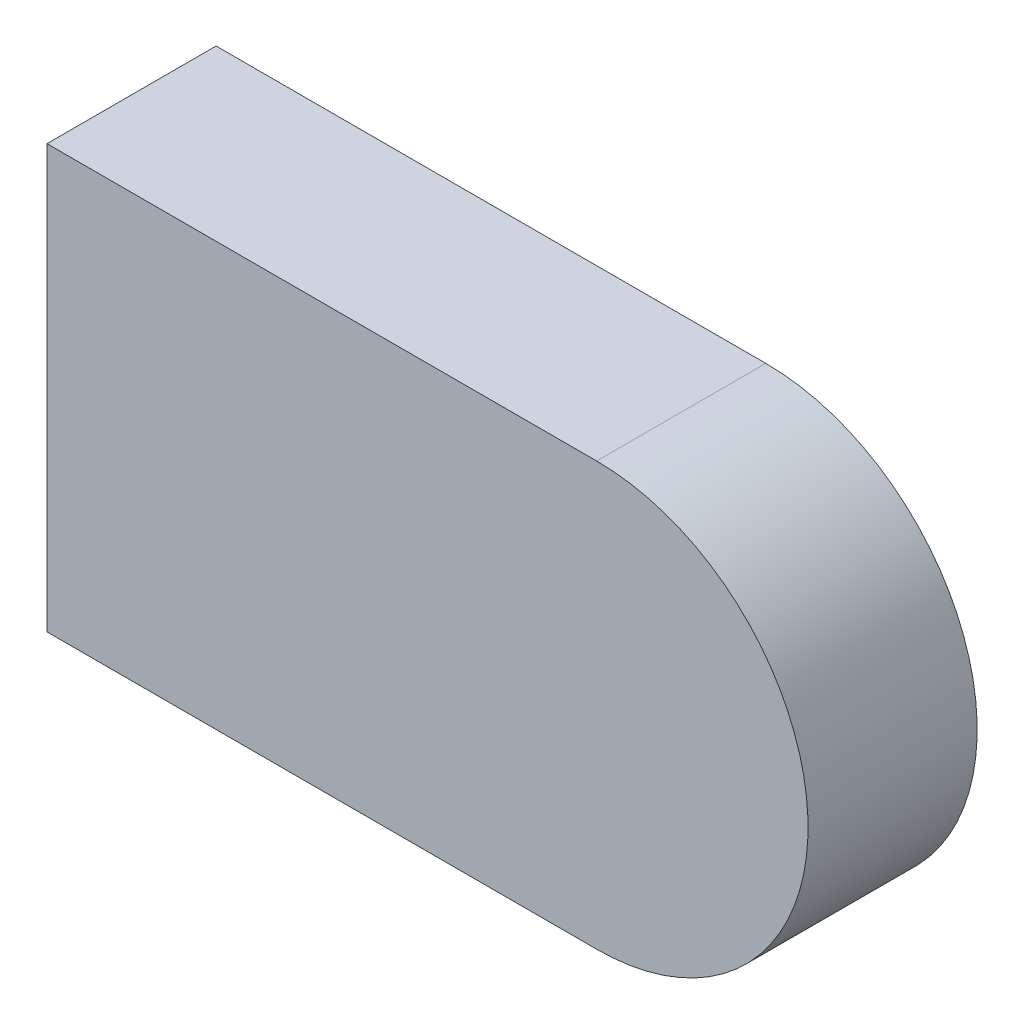
ISO-10303-21;
HEADER;
FILE_DESCRIPTION(('STEP AP214'),'2;1');
FILE_NAME('part.step','',(''),(''),'','','');
FILE_SCHEMA(('AUTOMOTIVE_DESIGN { 1 0 10303 214 1 1 1 1 }'));
ENDSEC;
DATA;
#1=APPLICATION_CONTEXT('core data for automotive mechanical design processes');
#2=APPLICATION_PROTOCOL_DEFINITION('international standard','automotive_design',2000,#1);
#3=PRODUCT_CONTEXT('',#1,'mechanical');
#4=PRODUCT('Part','Part','',(#3));
#5=PRODUCT_RELATED_PRODUCT_CATEGORY('part','',(#4));
#6=PRODUCT_DEFINITION_FORMATION('','',#4);
#7=PRODUCT_DEFINITION_CONTEXT('part definition',#1,'design');
#8=PRODUCT_DEFINITION('design','',#6,#7);
#9=PRODUCT_DEFINITION_SHAPE('','',#8);
#10=(LENGTH_UNIT() NAMED_UNIT(*) SI_UNIT(.MILLI.,.METRE.));
#11=(NAMED_UNIT(*) PLANE_ANGLE_UNIT() SI_UNIT($,.RADIAN.));
#12=(NAMED_UNIT(*) SI_UNIT($,.STERADIAN.) SOLID_ANGLE_UNIT());
#13=UNCERTAINTY_MEASURE_WITH_UNIT(LENGTH_MEASURE(1.E-05),#10,'distance_accuracy_value','');
#14=(GEOMETRIC_REPRESENTATION_CONTEXT(3) GLOBAL_UNCERTAINTY_ASSIGNED_CONTEXT((#13)) GLOBAL_UNIT_ASSIGNED_CONTEXT((#10,
#11,#12)) REPRESENTATION_CONTEXT('',''));
#15=CARTESIAN_POINT('',(0.,0.,0.));
#16=DIRECTION('',(0.,0.,1.));
#17=DIRECTION('',(1.,0.,0.));
#18=AXIS2_PLACEMENT_3D('',#15,#16,#17);
#19=CARTESIAN_POINT('',(-2.05,0.625,0.));
#20=DIRECTION('',(0.,1.,0.));
#21=DIRECTION('',(1.,0.,0.));
#22=AXIS2_PLACEMENT_3D('',#19,#20,#21);
#23=PLANE('',#22);
#24=DIRECTION('',(1.,0.,0.));
#25=VECTOR('',#24,1.);
#26=CARTESIAN_POINT('',(-2.05,0.625,0.));
#27=LINE('',#26,#25);
#28=CARTESIAN_POINT('',(-2.05,0.625,0.));
#29=VERTEX_POINT('',#28);
#30=CARTESIAN_POINT('',(-1.725,0.625,0.));
#31=VERTEX_POINT('',#30);
#32=EDGE_CURVE('E11',#29,#31,#27,.T.);
#33=ORIENTED_EDGE('',*,*,#32,.T.);
#34=DIRECTION('',(0.,0.,1.));
#35=VECTOR('',#34,1.);
#36=CARTESIAN_POINT('',(-1.725,0.625,0.));
#37=LINE('',#36,#35);
#38=CARTESIAN_POINT('',(-1.725,0.625,0.1));
#39=VERTEX_POINT('',#38);
#40=EDGE_CURVE('E24',#31,#39,#37,.T.);
#41=ORIENTED_EDGE('',*,*,#40,.T.);
#42=DIRECTION('',(1.,0.,0.));
#43=VECTOR('',#42,1.);
#44=CARTESIAN_POINT('',(-2.05,0.625,0.1));
#45=LINE('',#44,#43);
#46=CARTESIAN_POINT('',(-2.05,0.625,0.1));
#47=VERTEX_POINT('',#46);
#48=EDGE_CURVE('E88',#47,#39,#45,.T.);
#49=ORIENTED_EDGE('',*,*,#48,.F.);
#50=DIRECTION('',(0.,0.,1.));
#51=VECTOR('',#50,1.);
#52=CARTESIAN_POINT('',(-2.05,0.625,0.));
#53=LINE('',#52,#51);
#54=EDGE_CURVE('E36',#29,#47,#53,.T.);
#55=ORIENTED_EDGE('',*,*,#54,.F.);
#56=EDGE_LOOP('',(#33,#41,#49,#55));
#57=FACE_BOUND('',#56,.T.);
#58=ADVANCED_FACE('F17',(#57),#23,.F.);
#59=CARTESIAN_POINT('',(-1.725,0.75,0.));
#60=DIRECTION('',(0.,0.,-1.));
#61=DIRECTION('',(1.,0.,0.));
#62=AXIS2_PLACEMENT_3D('',#59,#60,#61);
#63=CYLINDRICAL_SURFACE('',#62,0.125);
#64=CARTESIAN_POINT('',(-1.725,0.75,0.));
#65=DIRECTION('',(0.,0.,1.));
#66=DIRECTION('',(1.,0.,0.));
#67=AXIS2_PLACEMENT_3D('',#64,#65,#66);
#68=CIRCLE('',#67,0.125);
#69=CARTESIAN_POINT('',(-1.725,0.875,0.));
#70=VERTEX_POINT('',#69);
#71=EDGE_CURVE('E85',#31,#70,#68,.T.);
#72=ORIENTED_EDGE('',*,*,#71,.T.);
#73=DIRECTION('',(0.,0.,1.));
#74=VECTOR('',#73,1.);
#75=CARTESIAN_POINT('',(-1.725,0.875,0.));
#76=LINE('',#75,#74);
#77=CARTESIAN_POINT('',(-1.725,0.875,0.1));
#78=VERTEX_POINT('',#77);
#79=EDGE_CURVE('E73',#70,#78,#76,.T.);
#80=ORIENTED_EDGE('',*,*,#79,.T.);
#81=CARTESIAN_POINT('',(-1.725,0.75,0.1));
#82=DIRECTION('',(0.,0.,1.));
#83=DIRECTION('',(1.,0.,0.));
#84=AXIS2_PLACEMENT_3D('',#81,#82,#83);
#85=CIRCLE('',#84,0.125);
#86=EDGE_CURVE('E66',#39,#78,#85,.T.);
#87=ORIENTED_EDGE('',*,*,#86,.F.);
#88=ORIENTED_EDGE('',*,*,#40,.F.);
#89=EDGE_LOOP('',(#72,#80,#87,#88));
#90=FACE_BOUND('',#89,.T.);
#91=ADVANCED_FACE('F89',(#90),#63,.T.);
#92=CARTESIAN_POINT('',(-2.05,0.875,0.));
#93=DIRECTION('',(0.,1.,0.));
#94=DIRECTION('',(1.,0.,0.));
#95=AXIS2_PLACEMENT_3D('',#92,#93,#94);
#96=PLANE('',#95);
#97=DIRECTION('',(0.,0.,1.));
#98=VECTOR('',#97,1.);
#99=CARTESIAN_POINT('',(-2.05,0.875,0.));
#100=LINE('',#99,#98);
#101=CARTESIAN_POINT('',(-2.05,0.875,0.));
#102=VERTEX_POINT('',#101);
#103=CARTESIAN_POINT('',(-2.05,0.875,0.1));
#104=VERTEX_POINT('',#103);
#105=EDGE_CURVE('E56',#102,#104,#100,.T.);
#106=ORIENTED_EDGE('',*,*,#105,.T.);
#107=DIRECTION('',(1.,0.,0.));
#108=VECTOR('',#107,1.);
#109=CARTESIAN_POINT('',(-2.05,0.875,0.1));
#110=LINE('',#109,#108);
#111=EDGE_CURVE('E67',#104,#78,#110,.T.);
#112=ORIENTED_EDGE('',*,*,#111,.T.);
#113=ORIENTED_EDGE('',*,*,#79,.F.);
#114=DIRECTION('',(1.,0.,0.));
#115=VECTOR('',#114,1.);
#116=CARTESIAN_POINT('',(-2.05,0.875,0.));
#117=LINE('',#116,#115);
#118=EDGE_CURVE('E71',#102,#70,#117,.T.);
#119=ORIENTED_EDGE('',*,*,#118,.F.);
#120=EDGE_LOOP('',(#106,#112,#113,#119));
#121=FACE_BOUND('',#120,.T.);
#122=ADVANCED_FACE('F72',(#121),#96,.T.);
#123=CARTESIAN_POINT('',(-2.05,0.625,0.));
#124=DIRECTION('',(-1.,0.,0.));
#125=DIRECTION('',(0.,1.,0.));
#126=AXIS2_PLACEMENT_3D('',#123,#124,#125);
#127=PLANE('',#126);
#128=ORIENTED_EDGE('',*,*,#54,.T.);
#129=DIRECTION('',(0.,1.,0.));
#130=VECTOR('',#129,1.);
#131=CARTESIAN_POINT('',(-2.05,0.625,0.1));
#132=LINE('',#131,#130);
#133=EDGE_CURVE('E62',#47,#104,#132,.T.);
#134=ORIENTED_EDGE('',*,*,#133,.T.);
#135=ORIENTED_EDGE('',*,*,#105,.F.);
#136=DIRECTION('',(0.,1.,0.));
#137=VECTOR('',#136,1.);
#138=CARTESIAN_POINT('',(-2.05,0.625,0.));
#139=LINE('',#138,#137);
#140=EDGE_CURVE('E60',#29,#102,#139,.T.);
#141=ORIENTED_EDGE('',*,*,#140,.F.);
#142=EDGE_LOOP('',(#128,#134,#135,#141));
#143=FACE_BOUND('',#142,.T.);
#144=ADVANCED_FACE('F58',(#143),#127,.T.);
#145=CARTESIAN_POINT('',(-1.850342514613,0.75,0.));
#146=DIRECTION('',(0.,0.,1.));
#147=DIRECTION('',(1.,0.,0.));
#148=AXIS2_PLACEMENT_3D('',#145,#146,#147);
#149=PLANE('',#148);
#150=ORIENTED_EDGE('',*,*,#140,.T.);
#151=ORIENTED_EDGE('',*,*,#118,.T.);
#152=ORIENTED_EDGE('',*,*,#71,.F.);
#153=ORIENTED_EDGE('',*,*,#32,.F.);
#154=EDGE_LOOP('',(#150,#151,#152,#153));
#155=FACE_BOUND('',#154,.T.);
#156=ADVANCED_FACE('F77',(#155),#149,.F.);
#157=CARTESIAN_POINT('',(-1.850342514613,0.75,0.1));
#158=DIRECTION('',(0.,0.,1.));
#159=DIRECTION('',(1.,0.,0.));
#160=AXIS2_PLACEMENT_3D('',#157,#158,#159);
#161=PLANE('',#160);
#162=ORIENTED_EDGE('',*,*,#48,.T.);
#163=ORIENTED_EDGE('',*,*,#86,.T.);
#164=ORIENTED_EDGE('',*,*,#111,.F.);
#165=ORIENTED_EDGE('',*,*,#133,.F.);
#166=EDGE_LOOP('',(#162,#163,#164,#165));
#167=FACE_BOUND('',#166,.T.);
#168=ADVANCED_FACE('F91',(#167),#161,.T.);
#169=CLOSED_SHELL('',(#58,#91,#122,#144,#156,#168));
#170=MANIFOLD_SOLID_BREP('B1',#169);
#171=ADVANCED_BREP_SHAPE_REPRESENTATION('',(#18,#170),#14);
#172=SHAPE_DEFINITION_REPRESENTATION(#9,#171);
ENDSEC;
END-ISO-10303-21;
